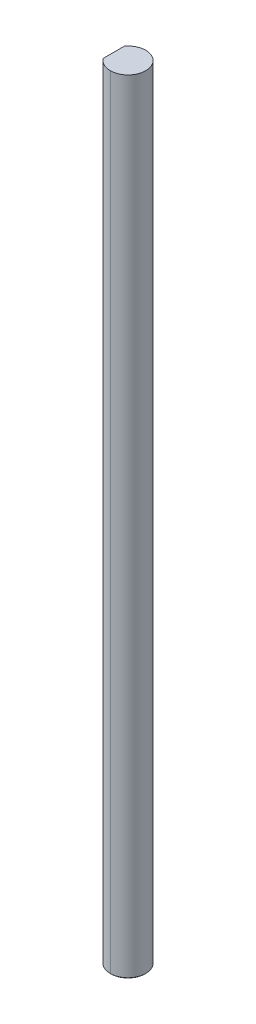
ISO-10303-21;
HEADER;
FILE_DESCRIPTION(('STEP AP214'),'2;1');
FILE_NAME('part.step','',(''),(''),'','','');
FILE_SCHEMA(('AUTOMOTIVE_DESIGN { 1 0 10303 214 1 1 1 1 }'));
ENDSEC;
DATA;
#1=APPLICATION_CONTEXT('core data for automotive mechanical design processes');
#2=APPLICATION_PROTOCOL_DEFINITION('international standard','automotive_design',2000,#1);
#3=PRODUCT_CONTEXT('',#1,'mechanical');
#4=PRODUCT('Part','Part','',(#3));
#5=PRODUCT_RELATED_PRODUCT_CATEGORY('part','',(#4));
#6=PRODUCT_DEFINITION_FORMATION('','',#4);
#7=PRODUCT_DEFINITION_CONTEXT('part definition',#1,'design');
#8=PRODUCT_DEFINITION('design','',#6,#7);
#9=PRODUCT_DEFINITION_SHAPE('','',#8);
#10=(LENGTH_UNIT() NAMED_UNIT(*) SI_UNIT(.MILLI.,.METRE.));
#11=(NAMED_UNIT(*) PLANE_ANGLE_UNIT() SI_UNIT($,.RADIAN.));
#12=(NAMED_UNIT(*) SI_UNIT($,.STERADIAN.) SOLID_ANGLE_UNIT());
#13=UNCERTAINTY_MEASURE_WITH_UNIT(LENGTH_MEASURE(1.E-05),#10,'distance_accuracy_value','');
#14=(GEOMETRIC_REPRESENTATION_CONTEXT(3) GLOBAL_UNCERTAINTY_ASSIGNED_CONTEXT((#13)) GLOBAL_UNIT_ASSIGNED_CONTEXT((#10,
#11,#12)) REPRESENTATION_CONTEXT('',''));
#15=CARTESIAN_POINT('',(0.,0.,0.));
#16=DIRECTION('',(0.,0.,1.));
#17=DIRECTION('',(1.,0.,0.));
#18=AXIS2_PLACEMENT_3D('',#15,#16,#17);
#19=CARTESIAN_POINT('',(0.,0.127000000000155,0.));
#20=DIRECTION('',(0.,1.,0.));
#21=DIRECTION('',(0.,0.,1.));
#22=AXIS2_PLACEMENT_3D('',#19,#20,#21);
#23=CONICAL_SURFACE('',#22,3.17119,0.785398163397595);
#24=DIRECTION('',(0.,0.707106781186444,-0.707106781186651));
#25=VECTOR('',#24,1.);
#26=CARTESIAN_POINT('',(0.,0.127000000000155,-3.17119));
#27=LINE('',#26,#25);
#28=CARTESIAN_POINT('',(0.,0.,-3.04418999999981));
#29=VERTEX_POINT('',#28);
#30=CARTESIAN_POINT('',(0.,0.127000000000155,-3.17119));
#31=VERTEX_POINT('',#30);
#32=EDGE_CURVE('E138',#29,#31,#27,.T.);
#33=ORIENTED_EDGE('',*,*,#32,.F.);
#34=CARTESIAN_POINT('',(0.,0.,0.));
#35=DIRECTION('',(0.,-1.,0.));
#36=DIRECTION('',(0.,0.,1.));
#37=AXIS2_PLACEMENT_3D('',#34,#35,#36);
#38=CIRCLE('',#37,3.04418999999981);
#39=CARTESIAN_POINT('',(-2.54381,0.,-1.67216130800794));
#40=VERTEX_POINT('',#39);
#41=EDGE_CURVE('E53',#40,#29,#38,.T.);
#42=ORIENTED_EDGE('',*,*,#41,.F.);
#43=CARTESIAN_POINT('',(-2.54381,0.127000000000155,-1.89353550270387));
#44=CARTESIAN_POINT('',(-2.54381,0.0833862535560478,-1.8204935785421));
#45=CARTESIAN_POINT('',(-2.54381,0.0409575857321033,-1.74672509100709));
#46=CARTESIAN_POINT('',(-2.54381,0.,-1.67216130800794));
#47=(BOUNDED_CURVE() B_SPLINE_CURVE(3,(#43,#44,#45,#46),.UNSPECIFIED.,.F.,
.F.) B_SPLINE_CURVE_WITH_KNOTS((4,4),(0.,0.00025521664145841),
.UNSPECIFIED.) CURVE() GEOMETRIC_REPRESENTATION_ITEM() RATIONAL_B_SPLINE_CURVE((1.,1.,1.,1.)) REPRESENTATION_ITEM(''));
#48=CARTESIAN_POINT('',(-2.54381,0.127000000000155,-1.89353550270387));
#49=VERTEX_POINT('',#48);
#50=EDGE_CURVE('E145',#49,#40,#47,.T.);
#51=ORIENTED_EDGE('',*,*,#50,.F.);
#52=CARTESIAN_POINT('',(0.,0.127000000000155,0.));
#53=DIRECTION('',(0.,1.,0.));
#54=DIRECTION('',(0.,0.,1.));
#55=AXIS2_PLACEMENT_3D('',#52,#53,#54);
#56=CIRCLE('',#55,3.17119);
#57=EDGE_CURVE('E127',#31,#49,#56,.T.);
#58=ORIENTED_EDGE('',*,*,#57,.F.);
#59=EDGE_LOOP('',(#33,#42,#51,#58));
#60=FACE_BOUND('',#59,.T.);
#61=ADVANCED_FACE('F44',(#60),#23,.T.);
#62=CARTESIAN_POINT('',(0.,0.,0.));
#63=DIRECTION('',(0.,1.,0.));
#64=DIRECTION('',(1.,0.,0.));
#65=AXIS2_PLACEMENT_3D('',#62,#63,#64);
#66=PLANE('',#65);
#67=DIRECTION('',(0.,0.,1.));
#68=VECTOR('',#67,1.);
#69=CARTESIAN_POINT('',(-2.54381,0.,-1.89353550270387));
#70=LINE('',#69,#68);
#71=CARTESIAN_POINT('',(-2.54381,0.,1.67216130800794));
#72=VERTEX_POINT('',#71);
#73=EDGE_CURVE('E151',#40,#72,#70,.T.);
#74=ORIENTED_EDGE('',*,*,#73,.F.);
#75=ORIENTED_EDGE('',*,*,#41,.T.);
#76=CARTESIAN_POINT('',(0.,0.,0.));
#77=DIRECTION('',(0.,-1.,0.));
#78=DIRECTION('',(0.,0.,1.));
#79=AXIS2_PLACEMENT_3D('',#76,#77,#78);
#80=CIRCLE('',#79,3.04418999999981);
#81=CARTESIAN_POINT('',(0.,0.,3.04418999999981));
#82=VERTEX_POINT('',#81);
#83=EDGE_CURVE('E118',#29,#82,#80,.T.);
#84=ORIENTED_EDGE('',*,*,#83,.T.);
#85=CARTESIAN_POINT('',(0.,0.,0.));
#86=DIRECTION('',(0.,-1.,0.));
#87=DIRECTION('',(0.,0.,1.));
#88=AXIS2_PLACEMENT_3D('',#85,#86,#87);
#89=CIRCLE('',#88,3.04418999999981);
#90=EDGE_CURVE('E159',#82,#72,#89,.T.);
#91=ORIENTED_EDGE('',*,*,#90,.T.);
#92=EDGE_LOOP('',(#74,#75,#84,#91));
#93=FACE_BOUND('',#92,.T.);
#94=ADVANCED_FACE('F199',(#93),#66,.F.);
#95=CARTESIAN_POINT('',(-2.54381,304.8,-1.89353550270387));
#96=DIRECTION('',(1.,0.,0.));
#97=DIRECTION('',(0.,1.,0.));
#98=AXIS2_PLACEMENT_3D('',#95,#96,#97);
#99=PLANE('',#98);
#100=DIRECTION('',(0.,-1.,0.));
#101=VECTOR('',#100,1.);
#102=CARTESIAN_POINT('',(-2.54381,304.8,1.89353550270387));
#103=LINE('',#102,#101);
#104=CARTESIAN_POINT('',(-2.54381,139.954,1.89353550270387));
#105=VERTEX_POINT('',#104);
#106=CARTESIAN_POINT('',(-2.54381,0.127000000000155,1.89353550270387));
#107=VERTEX_POINT('',#106);
#108=EDGE_CURVE('E141',#105,#107,#103,.T.);
#109=ORIENTED_EDGE('',*,*,#108,.F.);
#110=DIRECTION('',(0.,0.,1.));
#111=VECTOR('',#110,1.);
#112=CARTESIAN_POINT('',(-2.54381,139.954,3.17119));
#113=LINE('',#112,#111);
#114=CARTESIAN_POINT('',(-2.54381,139.954,-1.89353550270387));
#115=VERTEX_POINT('',#114);
#116=EDGE_CURVE('E101',#115,#105,#113,.T.);
#117=ORIENTED_EDGE('',*,*,#116,.F.);
#118=DIRECTION('',(0.,-1.,0.));
#119=VECTOR('',#118,1.);
#120=CARTESIAN_POINT('',(-2.54381,304.8,-1.89353550270387));
#121=LINE('',#120,#119);
#122=EDGE_CURVE('E139',#115,#49,#121,.T.);
#123=ORIENTED_EDGE('',*,*,#122,.T.);
#124=ORIENTED_EDGE('',*,*,#50,.T.);
#125=ORIENTED_EDGE('',*,*,#73,.T.);
#126=CARTESIAN_POINT('',(-2.54381,0.,1.67216130800794));
#127=CARTESIAN_POINT('',(-2.54381,0.0409575857321094,1.74672509100708));
#128=CARTESIAN_POINT('',(-2.54381,0.0833862535560442,1.8204935785421));
#129=CARTESIAN_POINT('',(-2.54381,0.127000000000155,1.89353550270387));
#130=(BOUNDED_CURVE() B_SPLINE_CURVE(3,(#126,#127,#128,#129),.UNSPECIFIED.,.F.,
.F.) B_SPLINE_CURVE_WITH_KNOTS((4,4),(0.,0.00025521664145841),
.UNSPECIFIED.) CURVE() GEOMETRIC_REPRESENTATION_ITEM() RATIONAL_B_SPLINE_CURVE((1.,1.,1.,1.)) REPRESENTATION_ITEM(''));
#131=EDGE_CURVE('E125',#72,#107,#130,.T.);
#132=ORIENTED_EDGE('',*,*,#131,.T.);
#133=EDGE_LOOP('',(#109,#117,#123,#124,#125,#132));
#134=FACE_BOUND('',#133,.T.);
#135=ADVANCED_FACE('F203',(#134),#99,.F.);
#136=CARTESIAN_POINT('',(0.,304.8,0.));
#137=DIRECTION('',(0.,-1.,0.));
#138=DIRECTION('',(0.,0.,-1.));
#139=AXIS2_PLACEMENT_3D('',#136,#137,#138);
#140=CYLINDRICAL_SURFACE('',#139,3.17119);
#141=CARTESIAN_POINT('',(0.,139.954,0.));
#142=DIRECTION('',(0.,-1.,0.));
#143=DIRECTION('',(0.,0.,-1.));
#144=AXIS2_PLACEMENT_3D('',#141,#142,#143);
#145=CIRCLE('',#144,3.17119);
#146=CARTESIAN_POINT('',(0.,139.954,3.17119));
#147=VERTEX_POINT('',#146);
#148=EDGE_CURVE('E114',#105,#147,#145,.F.);
#149=ORIENTED_EDGE('',*,*,#148,.F.);
#150=ORIENTED_EDGE('',*,*,#108,.T.);
#151=CARTESIAN_POINT('',(0.,0.127000000000155,0.));
#152=DIRECTION('',(0.,1.,0.));
#153=DIRECTION('',(0.,0.,1.));
#154=AXIS2_PLACEMENT_3D('',#151,#152,#153);
#155=CIRCLE('',#154,3.17119);
#156=CARTESIAN_POINT('',(0.,0.127000000000155,3.17119));
#157=VERTEX_POINT('',#156);
#158=EDGE_CURVE('E123',#107,#157,#155,.T.);
#159=ORIENTED_EDGE('',*,*,#158,.T.);
#160=DIRECTION('',(0.,-1.,0.));
#161=VECTOR('',#160,1.);
#162=CARTESIAN_POINT('',(0.,304.8,3.17119));
#163=LINE('',#162,#161);
#164=EDGE_CURVE('E111',#147,#157,#163,.T.);
#165=ORIENTED_EDGE('',*,*,#164,.F.);
#166=EDGE_LOOP('',(#149,#150,#159,#165));
#167=FACE_BOUND('',#166,.T.);
#168=ADVANCED_FACE('F121',(#167),#140,.T.);
#169=CARTESIAN_POINT('',(0.,304.8,0.));
#170=DIRECTION('',(0.,-1.,0.));
#171=DIRECTION('',(0.,0.,-1.));
#172=AXIS2_PLACEMENT_3D('',#169,#170,#171);
#173=CYLINDRICAL_SURFACE('',#172,3.17119);
#174=CARTESIAN_POINT('',(0.,139.954,0.));
#175=DIRECTION('',(0.,-1.,0.));
#176=DIRECTION('',(0.,0.,-1.));
#177=AXIS2_PLACEMENT_3D('',#174,#175,#176);
#178=CIRCLE('',#177,3.17119);
#179=CARTESIAN_POINT('',(0.,139.954,-3.17119));
#180=VERTEX_POINT('',#179);
#181=EDGE_CURVE('E119',#180,#115,#178,.F.);
#182=ORIENTED_EDGE('',*,*,#181,.F.);
#183=DIRECTION('',(0.,-1.,0.));
#184=VECTOR('',#183,1.);
#185=CARTESIAN_POINT('',(0.,304.8,-3.17119));
#186=LINE('',#185,#184);
#187=EDGE_CURVE('E113',#180,#31,#186,.T.);
#188=ORIENTED_EDGE('',*,*,#187,.T.);
#189=ORIENTED_EDGE('',*,*,#57,.T.);
#190=ORIENTED_EDGE('',*,*,#122,.F.);
#191=EDGE_LOOP('',(#182,#188,#189,#190));
#192=FACE_BOUND('',#191,.T.);
#193=ADVANCED_FACE('F46',(#192),#173,.T.);
#194=CARTESIAN_POINT('',(0.,304.8,0.));
#195=DIRECTION('',(0.,-1.,0.));
#196=DIRECTION('',(0.,0.,-1.));
#197=AXIS2_PLACEMENT_3D('',#194,#195,#196);
#198=CYLINDRICAL_SURFACE('',#197,3.17119);
#199=CARTESIAN_POINT('',(0.,139.954,0.));
#200=DIRECTION('',(0.,-1.,0.));
#201=DIRECTION('',(0.,0.,-1.));
#202=AXIS2_PLACEMENT_3D('',#199,#200,#201);
#203=CIRCLE('',#202,3.17119);
#204=EDGE_CURVE('E11',#147,#180,#203,.F.);
#205=ORIENTED_EDGE('',*,*,#204,.F.);
#206=ORIENTED_EDGE('',*,*,#164,.T.);
#207=CARTESIAN_POINT('',(0.,0.127000000000155,0.));
#208=DIRECTION('',(0.,1.,0.));
#209=DIRECTION('',(0.,0.,1.));
#210=AXIS2_PLACEMENT_3D('',#207,#208,#209);
#211=CIRCLE('',#210,3.17119);
#212=EDGE_CURVE('E134',#157,#31,#211,.T.);
#213=ORIENTED_EDGE('',*,*,#212,.T.);
#214=ORIENTED_EDGE('',*,*,#187,.F.);
#215=EDGE_LOOP('',(#205,#206,#213,#214));
#216=FACE_BOUND('',#215,.T.);
#217=ADVANCED_FACE('F108',(#216),#198,.T.);
#218=CARTESIAN_POINT('',(0.,0.127000000000155,0.));
#219=DIRECTION('',(0.,1.,0.));
#220=DIRECTION('',(0.,0.,1.));
#221=AXIS2_PLACEMENT_3D('',#218,#219,#220);
#222=CONICAL_SURFACE('',#221,3.17119,0.785398163397595);
#223=ORIENTED_EDGE('',*,*,#90,.F.);
#224=DIRECTION('',(0.,0.707106781186444,0.707106781186651));
#225=VECTOR('',#224,1.);
#226=CARTESIAN_POINT('',(0.,0.127000000000155,3.17119));
#227=LINE('',#226,#225);
#228=EDGE_CURVE('E137',#82,#157,#227,.T.);
#229=ORIENTED_EDGE('',*,*,#228,.T.);
#230=ORIENTED_EDGE('',*,*,#158,.F.);
#231=ORIENTED_EDGE('',*,*,#131,.F.);
#232=EDGE_LOOP('',(#223,#229,#230,#231));
#233=FACE_BOUND('',#232,.T.);
#234=ADVANCED_FACE('F184',(#233),#222,.T.);
#235=CARTESIAN_POINT('',(0.,0.127000000000155,0.));
#236=DIRECTION('',(0.,1.,0.));
#237=DIRECTION('',(0.,0.,1.));
#238=AXIS2_PLACEMENT_3D('',#235,#236,#237);
#239=CONICAL_SURFACE('',#238,3.17119,0.785398163397595);
#240=ORIENTED_EDGE('',*,*,#83,.F.);
#241=ORIENTED_EDGE('',*,*,#32,.T.);
#242=ORIENTED_EDGE('',*,*,#212,.F.);
#243=ORIENTED_EDGE('',*,*,#228,.F.);
#244=EDGE_LOOP('',(#240,#241,#242,#243));
#245=FACE_BOUND('',#244,.T.);
#246=ADVANCED_FACE('F194',(#245),#239,.T.);
#247=CARTESIAN_POINT('',(3.17119,139.954,3.17119));
#248=DIRECTION('',(0.,-1.,0.));
#249=DIRECTION('',(0.,0.,-1.));
#250=AXIS2_PLACEMENT_3D('',#247,#248,#249);
#251=PLANE('',#250);
#252=ORIENTED_EDGE('',*,*,#148,.T.);
#253=ORIENTED_EDGE('',*,*,#204,.T.);
#254=ORIENTED_EDGE('',*,*,#181,.T.);
#255=ORIENTED_EDGE('',*,*,#116,.T.);
#256=EDGE_LOOP('',(#252,#253,#254,#255));
#257=FACE_BOUND('',#256,.T.);
#258=ADVANCED_FACE('F115',(#257),#251,.F.);
#259=CLOSED_SHELL('',(#61,#94,#135,#168,#193,#217,#234,#246,#258));
#260=MANIFOLD_SOLID_BREP('B2',#259);
#261=ADVANCED_BREP_SHAPE_REPRESENTATION('',(#18,#260),#14);
#262=SHAPE_DEFINITION_REPRESENTATION(#9,#261);
ENDSEC;
END-ISO-10303-21;
